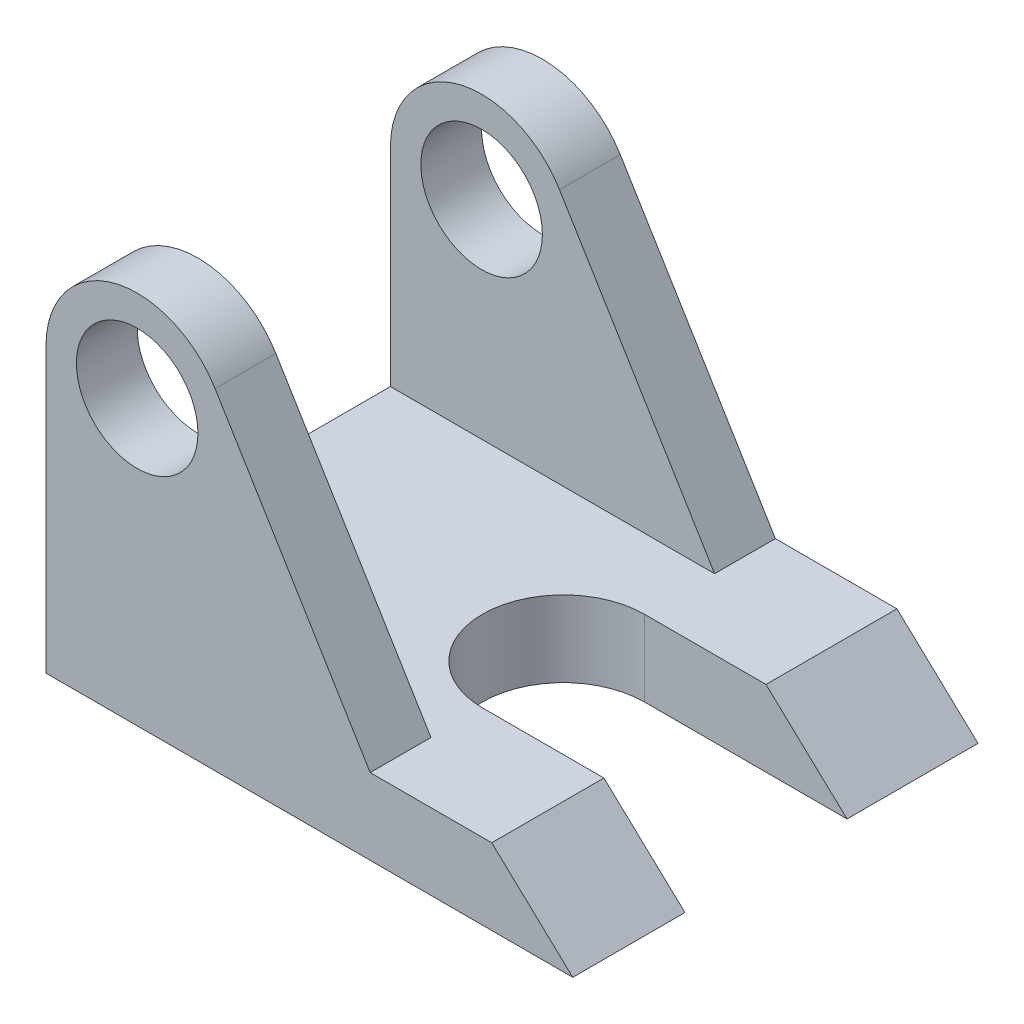
ISO-10303-21;
HEADER;
FILE_DESCRIPTION(('STEP AP214'),'2;1');
FILE_NAME('part.step','',(''),(''),'','','');
FILE_SCHEMA(('AUTOMOTIVE_DESIGN { 1 0 10303 214 1 1 1 1 }'));
ENDSEC;
DATA;
#1=APPLICATION_CONTEXT('core data for automotive mechanical design processes');
#2=APPLICATION_PROTOCOL_DEFINITION('international standard','automotive_design',2000,#1);
#3=PRODUCT_CONTEXT('',#1,'mechanical');
#4=PRODUCT('Part','Part','',(#3));
#5=PRODUCT_RELATED_PRODUCT_CATEGORY('part','',(#4));
#6=PRODUCT_DEFINITION_FORMATION('','',#4);
#7=PRODUCT_DEFINITION_CONTEXT('part definition',#1,'design');
#8=PRODUCT_DEFINITION('design','',#6,#7);
#9=PRODUCT_DEFINITION_SHAPE('','',#8);
#10=(LENGTH_UNIT() NAMED_UNIT(*) SI_UNIT(.MILLI.,.METRE.));
#11=(NAMED_UNIT(*) PLANE_ANGLE_UNIT() SI_UNIT($,.RADIAN.));
#12=(NAMED_UNIT(*) SI_UNIT($,.STERADIAN.) SOLID_ANGLE_UNIT());
#13=UNCERTAINTY_MEASURE_WITH_UNIT(LENGTH_MEASURE(1.E-05),#10,'distance_accuracy_value','');
#14=(GEOMETRIC_REPRESENTATION_CONTEXT(3) GLOBAL_UNCERTAINTY_ASSIGNED_CONTEXT((#13)) GLOBAL_UNIT_ASSIGNED_CONTEXT((#10,
#11,#12)) REPRESENTATION_CONTEXT('',''));
#15=CARTESIAN_POINT('',(0.,0.,0.));
#16=DIRECTION('',(0.,0.,1.));
#17=DIRECTION('',(1.,0.,0.));
#18=AXIS2_PLACEMENT_3D('',#15,#16,#17);
#19=CARTESIAN_POINT('',(80.3668287174947,-4.39949891949709,-100.));
#20=DIRECTION('',(0.684090794937473,0.729396863361652,0.));
#21=DIRECTION('',(-0.729396863361652,0.684090794937473,0.));
#22=AXIS2_PLACEMENT_3D('',#19,#20,#21);
#23=PLANE('',#22);
#24=DIRECTION('',(-0.729396863361652,0.684090794937473,0.));
#25=VECTOR('',#24,1.);
#26=CARTESIAN_POINT('',(80.3668287174947,-4.39949891949709,-67.6838528257323));
#27=LINE('',#26,#25);
#28=CARTESIAN_POINT('',(80.3668287174947,-4.39949891949709,-67.6838528257323));
#29=VERTEX_POINT('',#28);
#30=CARTESIAN_POINT('',(60.3668287174947,14.358212534995,-67.6838528257323));
#31=VERTEX_POINT('',#30);
#32=EDGE_CURVE('E291',#29,#31,#27,.T.);
#33=ORIENTED_EDGE('',*,*,#32,.F.);
#34=DIRECTION('',(0.,0.,1.));
#35=VECTOR('',#34,1.);
#36=CARTESIAN_POINT('',(80.3668287174947,-4.39949891949709,-100.));
#37=LINE('',#36,#35);
#38=CARTESIAN_POINT('',(80.3668287174947,-4.39949891949709,-100.));
#39=VERTEX_POINT('',#38);
#40=EDGE_CURVE('E192',#39,#29,#37,.T.);
#41=ORIENTED_EDGE('',*,*,#40,.F.);
#42=DIRECTION('',(-0.729396863361652,0.684090794937473,0.));
#43=VECTOR('',#42,1.);
#44=CARTESIAN_POINT('',(80.3668287174947,-4.39949891949709,-100.));
#45=LINE('',#44,#43);
#46=CARTESIAN_POINT('',(60.3668287174947,14.358212534995,-100.));
#47=VERTEX_POINT('',#46);
#48=EDGE_CURVE('E242',#39,#47,#45,.T.);
#49=ORIENTED_EDGE('',*,*,#48,.T.);
#50=DIRECTION('',(0.,0.,1.));
#51=VECTOR('',#50,1.);
#52=CARTESIAN_POINT('',(60.3668287174947,14.358212534995,-100.));
#53=LINE('',#52,#51);
#54=EDGE_CURVE('E196',#47,#31,#53,.T.);
#55=ORIENTED_EDGE('',*,*,#54,.T.);
#56=EDGE_LOOP('',(#33,#41,#49,#55));
#57=FACE_BOUND('',#56,.T.);
#58=ADVANCED_FACE('F45',(#57),#23,.T.);
#59=CARTESIAN_POINT('',(-27.1331712825053,65.6005010805029,-100.));
#60=DIRECTION('',(0.,0.,1.));
#61=DIRECTION('',(1.,0.,0.));
#62=AXIS2_PLACEMENT_3D('',#59,#60,#61);
#63=CYLINDRICAL_SURFACE('',#62,22.5);
#64=CARTESIAN_POINT('',(-27.1331712825053,65.6005010805029,-15.));
#65=DIRECTION('',(0.,0.,1.));
#66=DIRECTION('',(0.,-1.,0.));
#67=AXIS2_PLACEMENT_3D('',#64,#65,#66);
#68=CIRCLE('',#67,22.5);
#69=CARTESIAN_POINT('',(-49.6331712825053,65.6005010805029,-15.));
#70=VERTEX_POINT('',#69);
#71=CARTESIAN_POINT('',(-7.90944020395365,77.2923000618199,-15.));
#72=VERTEX_POINT('',#71);
#73=EDGE_CURVE('E267',#70,#72,#68,.F.);
#74=ORIENTED_EDGE('',*,*,#73,.F.);
#75=DIRECTION('',(0.,0.,1.));
#76=VECTOR('',#75,1.);
#77=CARTESIAN_POINT('',(-49.6331712825053,65.6005010805029,-100.));
#78=LINE('',#77,#76);
#79=CARTESIAN_POINT('',(-49.6331712825053,65.6005010805029,0.));
#80=VERTEX_POINT('',#79);
#81=EDGE_CURVE('E188',#70,#80,#78,.T.);
#82=ORIENTED_EDGE('',*,*,#81,.T.);
#83=CARTESIAN_POINT('',(-27.1331712825053,65.6005010805029,0.));
#84=DIRECTION('',(0.,0.,1.));
#85=DIRECTION('',(1.,0.,0.));
#86=AXIS2_PLACEMENT_3D('',#83,#84,#85);
#87=CIRCLE('',#86,22.5);
#88=CARTESIAN_POINT('',(-7.90944020395364,77.2923000618199,0.));
#89=VERTEX_POINT('',#88);
#90=EDGE_CURVE('E229',#89,#80,#87,.T.);
#91=ORIENTED_EDGE('',*,*,#90,.F.);
#92=DIRECTION('',(0.,0.,1.));
#93=VECTOR('',#92,1.);
#94=CARTESIAN_POINT('',(-7.90944020395364,77.2923000618199,-100.));
#95=LINE('',#94,#93);
#96=EDGE_CURVE('E204',#72,#89,#95,.T.);
#97=ORIENTED_EDGE('',*,*,#96,.F.);
#98=EDGE_LOOP('',(#74,#82,#91,#97));
#99=FACE_BOUND('',#98,.T.);
#100=ADVANCED_FACE('F316',(#99),#63,.T.);
#101=CARTESIAN_POINT('',(30.3668287174947,14.358212534995,-100.));
#102=DIRECTION('',(0.854388047935631,0.519635510280756,0.));
#103=DIRECTION('',(-0.519635510280756,0.854388047935631,0.));
#104=AXIS2_PLACEMENT_3D('',#101,#102,#103);
#105=PLANE('',#104);
#106=DIRECTION('',(0.519635510280756,-0.854388047935631,0.));
#107=VECTOR('',#106,1.);
#108=CARTESIAN_POINT('',(30.3668287174947,14.358212534995,-15.));
#109=LINE('',#108,#107);
#110=CARTESIAN_POINT('',(30.3668287174947,14.358212534995,-15.));
#111=VERTEX_POINT('',#110);
#112=EDGE_CURVE('E261',#72,#111,#109,.T.);
#113=ORIENTED_EDGE('',*,*,#112,.F.);
#114=ORIENTED_EDGE('',*,*,#96,.T.);
#115=DIRECTION('',(-0.519635510280756,0.854388047935631,0.));
#116=VECTOR('',#115,1.);
#117=CARTESIAN_POINT('',(30.3668287174947,14.358212534995,0.));
#118=LINE('',#117,#116);
#119=CARTESIAN_POINT('',(30.3668287174947,14.358212534995,0.));
#120=VERTEX_POINT('',#119);
#121=EDGE_CURVE('E208',#120,#89,#118,.T.);
#122=ORIENTED_EDGE('',*,*,#121,.F.);
#123=DIRECTION('',(0.,0.,1.));
#124=VECTOR('',#123,1.);
#125=CARTESIAN_POINT('',(30.3668287174947,14.358212534995,-100.));
#126=LINE('',#125,#124);
#127=EDGE_CURVE('E200',#111,#120,#126,.T.);
#128=ORIENTED_EDGE('',*,*,#127,.F.);
#129=EDGE_LOOP('',(#113,#114,#122,#128));
#130=FACE_BOUND('',#129,.T.);
#131=ADVANCED_FACE('F327',(#130),#105,.T.);
#132=CARTESIAN_POINT('',(-27.1331712825053,65.6005010805029,-100.));
#133=DIRECTION('',(0.,0.,1.));
#134=DIRECTION('',(1.,0.,0.));
#135=AXIS2_PLACEMENT_3D('',#132,#133,#134);
#136=CYLINDRICAL_SURFACE('',#135,15.);
#137=CARTESIAN_POINT('',(-27.1331712825053,65.6005010805029,-15.));
#138=DIRECTION('',(0.,0.,1.));
#139=DIRECTION('',(0.,-1.,0.));
#140=AXIS2_PLACEMENT_3D('',#137,#138,#139);
#141=CIRCLE('',#140,15.);
#142=CARTESIAN_POINT('',(-27.1331712825053,50.6005010805029,-15.));
#143=VERTEX_POINT('',#142);
#144=EDGE_CURVE('E172',#143,#143,#141,.F.);
#145=ORIENTED_EDGE('',*,*,#144,.T.);
#146=EDGE_LOOP('',(#145));
#147=FACE_BOUND('',#146,.T.);
#148=CARTESIAN_POINT('',(-27.1331712825053,65.6005010805029,0.));
#149=DIRECTION('',(0.,0.,1.));
#150=DIRECTION('',(1.,0.,0.));
#151=AXIS2_PLACEMENT_3D('',#148,#149,#150);
#152=CIRCLE('',#151,15.);
#153=CARTESIAN_POINT('',(-12.1331712825053,65.6005010805029,0.));
#154=VERTEX_POINT('',#153);
#155=EDGE_CURVE('E257',#154,#154,#152,.T.);
#156=ORIENTED_EDGE('',*,*,#155,.T.);
#157=EDGE_LOOP('',(#156));
#158=FACE_BOUND('',#157,.T.);
#159=ADVANCED_FACE('F390',(#147,#158),#136,.F.);
#160=CARTESIAN_POINT('',(-49.6331712825053,65.6005010805029,-100.));
#161=VERTEX_POINT('',#160);
#162=CARTESIAN_POINT('',(-49.6331712825053,65.6005010805029,-85.));
#163=VERTEX_POINT('',#162);
#164=EDGE_CURVE('E183',#161,#163,#78,.T.);
#165=ORIENTED_EDGE('',*,*,#164,.T.);
#166=CARTESIAN_POINT('',(-27.1331712825053,65.6005010805029,-85.));
#167=DIRECTION('',(0.,0.,-1.));
#168=DIRECTION('',(0.,1.,0.));
#169=AXIS2_PLACEMENT_3D('',#166,#167,#168);
#170=CIRCLE('',#169,22.5);
#171=CARTESIAN_POINT('',(-7.90944020395365,77.2923000618199,-85.));
#172=VERTEX_POINT('',#171);
#173=EDGE_CURVE('E275',#172,#163,#170,.F.);
#174=ORIENTED_EDGE('',*,*,#173,.F.);
#175=CARTESIAN_POINT('',(-7.90944020395364,77.2923000618199,-100.));
#176=VERTEX_POINT('',#175);
#177=EDGE_CURVE('E171',#176,#172,#95,.T.);
#178=ORIENTED_EDGE('',*,*,#177,.F.);
#179=CARTESIAN_POINT('',(-27.1331712825053,65.6005010805029,-100.));
#180=DIRECTION('',(0.,0.,1.));
#181=DIRECTION('',(1.,0.,0.));
#182=AXIS2_PLACEMENT_3D('',#179,#180,#181);
#183=CIRCLE('',#182,22.5);
#184=EDGE_CURVE('E212',#176,#161,#183,.T.);
#185=ORIENTED_EDGE('',*,*,#184,.T.);
#186=EDGE_LOOP('',(#165,#174,#178,#185));
#187=FACE_BOUND('',#186,.T.);
#188=ADVANCED_FACE('F47',(#187),#63,.T.);
#189=DIRECTION('',(-0.519635510280756,0.854388047935631,0.));
#190=VECTOR('',#189,1.);
#191=CARTESIAN_POINT('',(30.3668287174947,14.358212534995,-85.));
#192=LINE('',#191,#190);
#193=CARTESIAN_POINT('',(30.3668287174947,14.358212534995,-85.));
#194=VERTEX_POINT('',#193);
#195=EDGE_CURVE('E177',#194,#172,#192,.T.);
#196=ORIENTED_EDGE('',*,*,#195,.F.);
#197=CARTESIAN_POINT('',(30.3668287174947,14.358212534995,-100.));
#198=VERTEX_POINT('',#197);
#199=EDGE_CURVE('E201',#198,#194,#126,.T.);
#200=ORIENTED_EDGE('',*,*,#199,.F.);
#201=DIRECTION('',(-0.519635510280756,0.854388047935631,0.));
#202=VECTOR('',#201,1.);
#203=CARTESIAN_POINT('',(30.3668287174947,14.358212534995,-100.));
#204=LINE('',#203,#202);
#205=EDGE_CURVE('E234',#198,#176,#204,.T.);
#206=ORIENTED_EDGE('',*,*,#205,.T.);
#207=ORIENTED_EDGE('',*,*,#177,.T.);
#208=EDGE_LOOP('',(#196,#200,#206,#207));
#209=FACE_BOUND('',#208,.T.);
#210=ADVANCED_FACE('F348',(#209),#105,.T.);
#211=CARTESIAN_POINT('',(60.3668287174947,14.358212534995,-100.));
#212=DIRECTION('',(0.,1.,0.));
#213=DIRECTION('',(-1.,0.,0.));
#214=AXIS2_PLACEMENT_3D('',#211,#212,#213);
#215=PLANE('',#214);
#216=DIRECTION('',(-1.,0.,0.));
#217=VECTOR('',#216,1.);
#218=CARTESIAN_POINT('',(60.3668287174947,14.358212534995,-67.6838528257323));
#219=LINE('',#218,#217);
#220=CARTESIAN_POINT('',(30.3668287174947,14.358212534995,-67.6838528257323));
#221=VERTEX_POINT('',#220);
#222=EDGE_CURVE('E288',#31,#221,#219,.T.);
#223=ORIENTED_EDGE('',*,*,#222,.F.);
#224=ORIENTED_EDGE('',*,*,#54,.F.);
#225=DIRECTION('',(-1.,0.,0.));
#226=VECTOR('',#225,1.);
#227=CARTESIAN_POINT('',(60.3668287174947,14.358212534995,-100.));
#228=LINE('',#227,#226);
#229=EDGE_CURVE('E238',#47,#198,#228,.T.);
#230=ORIENTED_EDGE('',*,*,#229,.T.);
#231=ORIENTED_EDGE('',*,*,#199,.T.);
#232=DIRECTION('',(1.,0.,0.));
#233=VECTOR('',#232,1.);
#234=CARTESIAN_POINT('',(-50.,14.358212534995,-85.));
#235=LINE('',#234,#233);
#236=CARTESIAN_POINT('',(-49.6331712825053,14.358212534995,-85.));
#237=VERTEX_POINT('',#236);
#238=EDGE_CURVE('E69',#237,#194,#235,.T.);
#239=ORIENTED_EDGE('',*,*,#238,.F.);
#240=DIRECTION('',(0.,0.,1.));
#241=VECTOR('',#240,1.);
#242=CARTESIAN_POINT('',(-49.6331712825053,14.358212534995,-100.));
#243=LINE('',#242,#241);
#244=CARTESIAN_POINT('',(-49.6331712825053,14.358212534995,-15.));
#245=VERTEX_POINT('',#244);
#246=EDGE_CURVE('E153',#237,#245,#243,.T.);
#247=ORIENTED_EDGE('',*,*,#246,.T.);
#248=DIRECTION('',(1.,0.,0.));
#249=VECTOR('',#248,1.);
#250=CARTESIAN_POINT('',(-50.,14.358212534995,-15.));
#251=LINE('',#250,#249);
#252=EDGE_CURVE('E280',#245,#111,#251,.T.);
#253=ORIENTED_EDGE('',*,*,#252,.T.);
#254=ORIENTED_EDGE('',*,*,#127,.T.);
#255=DIRECTION('',(-1.,0.,0.));
#256=VECTOR('',#255,1.);
#257=CARTESIAN_POINT('',(60.3668287174947,14.358212534995,0.));
#258=LINE('',#257,#256);
#259=CARTESIAN_POINT('',(60.3668287174947,14.358212534995,0.));
#260=VERTEX_POINT('',#259);
#261=EDGE_CURVE('E213',#260,#120,#258,.T.);
#262=ORIENTED_EDGE('',*,*,#261,.F.);
#263=CARTESIAN_POINT('',(60.3668287174947,14.358212534995,-27.6838528257323));
#264=VERTEX_POINT('',#263);
#265=EDGE_CURVE('E195',#264,#260,#53,.T.);
#266=ORIENTED_EDGE('',*,*,#265,.F.);
#267=DIRECTION('',(1.,0.,0.));
#268=VECTOR('',#267,1.);
#269=CARTESIAN_POINT('',(60.3668287174947,14.358212534995,-27.6838528257323));
#270=LINE('',#269,#268);
#271=CARTESIAN_POINT('',(30.3668287174947,14.358212534995,-27.6838528257323));
#272=VERTEX_POINT('',#271);
#273=EDGE_CURVE('E294',#272,#264,#270,.T.);
#274=ORIENTED_EDGE('',*,*,#273,.F.);
#275=CARTESIAN_POINT('',(30.3668287174947,14.358212534995,-47.6838528257323));
#276=DIRECTION('',(0.,1.,0.));
#277=DIRECTION('',(-1.,0.,0.));
#278=AXIS2_PLACEMENT_3D('',#275,#276,#277);
#279=CIRCLE('',#278,20.);
#280=EDGE_CURVE('E160',#221,#272,#279,.T.);
#281=ORIENTED_EDGE('',*,*,#280,.F.);
#282=EDGE_LOOP('',(#223,#224,#230,#231,#239,#247,#253,#254,#262,#266,#274,#281));
#283=FACE_BOUND('',#282,.T.);
#284=ADVANCED_FACE('F302',(#283),#215,.T.);
#285=DIRECTION('',(0.729396863361652,-0.684090794937473,0.));
#286=VECTOR('',#285,1.);
#287=CARTESIAN_POINT('',(80.3668287174947,-4.39949891949709,-27.6838528257323));
#288=LINE('',#287,#286);
#289=CARTESIAN_POINT('',(80.3668287174947,-4.39949891949709,-27.6838528257323));
#290=VERTEX_POINT('',#289);
#291=EDGE_CURVE('E61',#264,#290,#288,.T.);
#292=ORIENTED_EDGE('',*,*,#291,.F.);
#293=ORIENTED_EDGE('',*,*,#265,.T.);
#294=DIRECTION('',(-0.729396863361652,0.684090794937473,0.));
#295=VECTOR('',#294,1.);
#296=CARTESIAN_POINT('',(80.3668287174947,-4.39949891949709,0.));
#297=LINE('',#296,#295);
#298=CARTESIAN_POINT('',(80.3668287174947,-4.39949891949709,0.));
#299=VERTEX_POINT('',#298);
#300=EDGE_CURVE('E217',#299,#260,#297,.T.);
#301=ORIENTED_EDGE('',*,*,#300,.F.);
#302=EDGE_CURVE('E191',#290,#299,#37,.T.);
#303=ORIENTED_EDGE('',*,*,#302,.F.);
#304=EDGE_LOOP('',(#292,#293,#301,#303));
#305=FACE_BOUND('',#304,.T.);
#306=ADVANCED_FACE('F306',(#305),#23,.T.);
#307=CARTESIAN_POINT('',(-49.6331712825053,-4.39949891949709,-100.));
#308=DIRECTION('',(0.,-1.,0.));
#309=DIRECTION('',(0.,0.,-1.));
#310=AXIS2_PLACEMENT_3D('',#307,#308,#309);
#311=PLANE('',#310);
#312=DIRECTION('',(1.,0.,0.));
#313=VECTOR('',#312,1.);
#314=CARTESIAN_POINT('',(-49.6331712825053,-4.39949891949709,-67.6838528257323));
#315=LINE('',#314,#313);
#316=CARTESIAN_POINT('',(30.3668287174947,-4.39949891949709,-67.6838528257323));
#317=VERTEX_POINT('',#316);
#318=EDGE_CURVE('E11',#317,#29,#315,.T.);
#319=ORIENTED_EDGE('',*,*,#318,.F.);
#320=CARTESIAN_POINT('',(30.3668287174947,-4.39949891949709,-47.6838528257323));
#321=DIRECTION('',(0.,-1.,0.));
#322=DIRECTION('',(0.,0.,-1.));
#323=AXIS2_PLACEMENT_3D('',#320,#321,#322);
#324=CIRCLE('',#323,20.);
#325=CARTESIAN_POINT('',(30.3668287174947,-4.39949891949709,-27.6838528257323));
#326=VERTEX_POINT('',#325);
#327=EDGE_CURVE('E54',#326,#317,#324,.T.);
#328=ORIENTED_EDGE('',*,*,#327,.F.);
#329=DIRECTION('',(-1.,0.,0.));
#330=VECTOR('',#329,1.);
#331=CARTESIAN_POINT('',(-49.6331712825053,-4.39949891949709,-27.6838528257323));
#332=LINE('',#331,#330);
#333=EDGE_CURVE('E144',#290,#326,#332,.T.);
#334=ORIENTED_EDGE('',*,*,#333,.F.);
#335=ORIENTED_EDGE('',*,*,#302,.T.);
#336=DIRECTION('',(1.,0.,0.));
#337=VECTOR('',#336,1.);
#338=CARTESIAN_POINT('',(-49.6331712825053,-4.39949891949709,0.));
#339=LINE('',#338,#337);
#340=CARTESIAN_POINT('',(-49.6331712825053,-4.39949891949709,0.));
#341=VERTEX_POINT('',#340);
#342=EDGE_CURVE('E221',#341,#299,#339,.T.);
#343=ORIENTED_EDGE('',*,*,#342,.F.);
#344=DIRECTION('',(0.,0.,1.));
#345=VECTOR('',#344,1.);
#346=CARTESIAN_POINT('',(-49.6331712825053,-4.39949891949709,-100.));
#347=LINE('',#346,#345);
#348=CARTESIAN_POINT('',(-49.6331712825053,-4.39949891949709,-100.));
#349=VERTEX_POINT('',#348);
#350=EDGE_CURVE('E187',#349,#341,#347,.T.);
#351=ORIENTED_EDGE('',*,*,#350,.F.);
#352=DIRECTION('',(1.,0.,0.));
#353=VECTOR('',#352,1.);
#354=CARTESIAN_POINT('',(-49.6331712825053,-4.39949891949709,-100.));
#355=LINE('',#354,#353);
#356=EDGE_CURVE('E246',#349,#39,#355,.T.);
#357=ORIENTED_EDGE('',*,*,#356,.T.);
#358=ORIENTED_EDGE('',*,*,#40,.T.);
#359=EDGE_LOOP('',(#319,#328,#334,#335,#343,#351,#357,#358));
#360=FACE_BOUND('',#359,.T.);
#361=ADVANCED_FACE('F165',(#360),#311,.T.);
#362=CARTESIAN_POINT('',(-49.6331712825053,65.6005010805029,-100.));
#363=DIRECTION('',(-1.,0.,0.));
#364=DIRECTION('',(0.,-1.,0.));
#365=AXIS2_PLACEMENT_3D('',#362,#363,#364);
#366=PLANE('',#365);
#367=DIRECTION('',(0.,1.,0.));
#368=VECTOR('',#367,1.);
#369=CARTESIAN_POINT('',(-49.6331712825053,65.6005010805029,-15.));
#370=LINE('',#369,#368);
#371=EDGE_CURVE('E176',#245,#70,#370,.T.);
#372=ORIENTED_EDGE('',*,*,#371,.F.);
#373=ORIENTED_EDGE('',*,*,#246,.F.);
#374=DIRECTION('',(0.,-1.,0.));
#375=VECTOR('',#374,1.);
#376=CARTESIAN_POINT('',(-49.6331712825053,65.6005010805029,-85.));
#377=LINE('',#376,#375);
#378=EDGE_CURVE('E182',#163,#237,#377,.T.);
#379=ORIENTED_EDGE('',*,*,#378,.F.);
#380=ORIENTED_EDGE('',*,*,#164,.F.);
#381=DIRECTION('',(0.,-1.,0.));
#382=VECTOR('',#381,1.);
#383=CARTESIAN_POINT('',(-49.6331712825053,65.6005010805029,-100.));
#384=LINE('',#383,#382);
#385=EDGE_CURVE('E250',#161,#349,#384,.T.);
#386=ORIENTED_EDGE('',*,*,#385,.T.);
#387=ORIENTED_EDGE('',*,*,#350,.T.);
#388=DIRECTION('',(0.,-1.,0.));
#389=VECTOR('',#388,1.);
#390=CARTESIAN_POINT('',(-49.6331712825053,65.6005010805029,0.));
#391=LINE('',#390,#389);
#392=EDGE_CURVE('E225',#80,#341,#391,.T.);
#393=ORIENTED_EDGE('',*,*,#392,.F.);
#394=ORIENTED_EDGE('',*,*,#81,.F.);
#395=EDGE_LOOP('',(#372,#373,#379,#380,#386,#387,#393,#394));
#396=FACE_BOUND('',#395,.T.);
#397=ADVANCED_FACE('F320',(#396),#366,.T.);
#398=CARTESIAN_POINT('',(-27.1331712825053,65.6005010805029,-100.));
#399=DIRECTION('',(0.,0.,1.));
#400=DIRECTION('',(1.,0.,0.));
#401=AXIS2_PLACEMENT_3D('',#398,#399,#400);
#402=PLANE('',#401);
#403=CARTESIAN_POINT('',(-27.1331712825053,65.6005010805029,-100.));
#404=DIRECTION('',(0.,0.,1.));
#405=DIRECTION('',(1.,0.,0.));
#406=AXIS2_PLACEMENT_3D('',#403,#404,#405);
#407=CIRCLE('',#406,15.);
#408=CARTESIAN_POINT('',(-12.1331712825053,65.6005010805029,-100.));
#409=VERTEX_POINT('',#408);
#410=EDGE_CURVE('E233',#409,#409,#407,.T.);
#411=ORIENTED_EDGE('',*,*,#410,.T.);
#412=EDGE_LOOP('',(#411));
#413=FACE_BOUND('',#412,.T.);
#414=ORIENTED_EDGE('',*,*,#184,.F.);
#415=ORIENTED_EDGE('',*,*,#205,.F.);
#416=ORIENTED_EDGE('',*,*,#229,.F.);
#417=ORIENTED_EDGE('',*,*,#48,.F.);
#418=ORIENTED_EDGE('',*,*,#356,.F.);
#419=ORIENTED_EDGE('',*,*,#385,.F.);
#420=EDGE_LOOP('',(#414,#415,#416,#417,#418,#419));
#421=FACE_BOUND('',#420,.T.);
#422=ADVANCED_FACE('F343',(#413,#421),#402,.F.);
#423=CARTESIAN_POINT('',(-27.1331712825053,65.6005010805029,0.));
#424=DIRECTION('',(0.,0.,1.));
#425=DIRECTION('',(1.,0.,0.));
#426=AXIS2_PLACEMENT_3D('',#423,#424,#425);
#427=PLANE('',#426);
#428=ORIENTED_EDGE('',*,*,#155,.F.);
#429=EDGE_LOOP('',(#428));
#430=FACE_BOUND('',#429,.T.);
#431=ORIENTED_EDGE('',*,*,#90,.T.);
#432=ORIENTED_EDGE('',*,*,#392,.T.);
#433=ORIENTED_EDGE('',*,*,#342,.T.);
#434=ORIENTED_EDGE('',*,*,#300,.T.);
#435=ORIENTED_EDGE('',*,*,#261,.T.);
#436=ORIENTED_EDGE('',*,*,#121,.T.);
#437=EDGE_LOOP('',(#431,#432,#433,#434,#435,#436));
#438=FACE_BOUND('',#437,.T.);
#439=ADVANCED_FACE('F322',(#430,#438),#427,.T.);
#440=CARTESIAN_POINT('',(-27.1331712825053,65.6005010805029,-85.));
#441=DIRECTION('',(0.,0.,-1.));
#442=DIRECTION('',(0.,1.,0.));
#443=AXIS2_PLACEMENT_3D('',#440,#441,#442);
#444=CIRCLE('',#443,15.);
#445=CARTESIAN_POINT('',(-27.1331712825053,80.6005010805029,-85.));
#446=VERTEX_POINT('',#445);
#447=EDGE_CURVE('E178',#446,#446,#444,.F.);
#448=ORIENTED_EDGE('',*,*,#447,.T.);
#449=EDGE_LOOP('',(#448));
#450=FACE_BOUND('',#449,.T.);
#451=ORIENTED_EDGE('',*,*,#410,.F.);
#452=EDGE_LOOP('',(#451));
#453=FACE_BOUND('',#452,.T.);
#454=ADVANCED_FACE('F382',(#450,#453),#136,.F.);
#455=CARTESIAN_POINT('',(-50.,88.1005010805029,-15.));
#456=DIRECTION('',(0.,0.,1.));
#457=DIRECTION('',(0.,-1.,0.));
#458=AXIS2_PLACEMENT_3D('',#455,#456,#457);
#459=PLANE('',#458);
#460=ORIENTED_EDGE('',*,*,#112,.T.);
#461=ORIENTED_EDGE('',*,*,#252,.F.);
#462=ORIENTED_EDGE('',*,*,#371,.T.);
#463=ORIENTED_EDGE('',*,*,#73,.T.);
#464=EDGE_LOOP('',(#460,#461,#462,#463));
#465=FACE_BOUND('',#464,.T.);
#466=ORIENTED_EDGE('',*,*,#144,.F.);
#467=EDGE_LOOP('',(#466));
#468=FACE_BOUND('',#467,.T.);
#469=ADVANCED_FACE('F333',(#465,#468),#459,.F.);
#470=CARTESIAN_POINT('',(-50.,88.1005010805029,-85.));
#471=DIRECTION('',(0.,0.,-1.));
#472=DIRECTION('',(0.,1.,0.));
#473=AXIS2_PLACEMENT_3D('',#470,#471,#472);
#474=PLANE('',#473);
#475=ORIENTED_EDGE('',*,*,#195,.T.);
#476=ORIENTED_EDGE('',*,*,#173,.T.);
#477=ORIENTED_EDGE('',*,*,#378,.T.);
#478=ORIENTED_EDGE('',*,*,#238,.T.);
#479=EDGE_LOOP('',(#475,#476,#477,#478));
#480=FACE_BOUND('',#479,.T.);
#481=ORIENTED_EDGE('',*,*,#447,.F.);
#482=EDGE_LOOP('',(#481));
#483=FACE_BOUND('',#482,.T.);
#484=ADVANCED_FACE('F360',(#480,#483),#474,.F.);
#485=CARTESIAN_POINT('',(30.3668287174947,-5.641787465005,-47.6838528257323));
#486=DIRECTION('',(0.,1.,0.));
#487=DIRECTION('',(-1.,0.,0.));
#488=AXIS2_PLACEMENT_3D('',#485,#486,#487);
#489=CYLINDRICAL_SURFACE('',#488,20.);
#490=ORIENTED_EDGE('',*,*,#280,.T.);
#491=DIRECTION('',(0.,1.,0.));
#492=VECTOR('',#491,1.);
#493=CARTESIAN_POINT('',(30.3668287174947,-5.641787465005,-27.6838528257323));
#494=LINE('',#493,#492);
#495=EDGE_CURVE('E147',#326,#272,#494,.T.);
#496=ORIENTED_EDGE('',*,*,#495,.F.);
#497=ORIENTED_EDGE('',*,*,#327,.T.);
#498=DIRECTION('',(0.,1.,0.));
#499=VECTOR('',#498,1.);
#500=CARTESIAN_POINT('',(30.3668287174947,-5.641787465005,-67.6838528257323));
#501=LINE('',#500,#499);
#502=EDGE_CURVE('E162',#317,#221,#501,.T.);
#503=ORIENTED_EDGE('',*,*,#502,.T.);
#504=EDGE_LOOP('',(#490,#496,#497,#503));
#505=FACE_BOUND('',#504,.T.);
#506=ADVANCED_FACE('F156',(#505),#489,.F.);
#507=CARTESIAN_POINT('',(30.3668287174947,-5.641787465005,-67.6838528257323));
#508=DIRECTION('',(0.,0.,-1.));
#509=DIRECTION('',(-1.,0.,0.));
#510=AXIS2_PLACEMENT_3D('',#507,#508,#509);
#511=PLANE('',#510);
#512=ORIENTED_EDGE('',*,*,#222,.T.);
#513=ORIENTED_EDGE('',*,*,#502,.F.);
#514=ORIENTED_EDGE('',*,*,#318,.T.);
#515=ORIENTED_EDGE('',*,*,#32,.T.);
#516=EDGE_LOOP('',(#512,#513,#514,#515));
#517=FACE_BOUND('',#516,.T.);
#518=ADVANCED_FACE('F352',(#517),#511,.F.);
#519=CARTESIAN_POINT('',(30.3668287174947,-5.641787465005,-27.6838528257323));
#520=DIRECTION('',(0.,0.,1.));
#521=DIRECTION('',(1.,0.,0.));
#522=AXIS2_PLACEMENT_3D('',#519,#520,#521);
#523=PLANE('',#522);
#524=ORIENTED_EDGE('',*,*,#273,.T.);
#525=ORIENTED_EDGE('',*,*,#291,.T.);
#526=ORIENTED_EDGE('',*,*,#333,.T.);
#527=ORIENTED_EDGE('',*,*,#495,.T.);
#528=EDGE_LOOP('',(#524,#525,#526,#527));
#529=FACE_BOUND('',#528,.T.);
#530=ADVANCED_FACE('F146',(#529),#523,.F.);
#531=CLOSED_SHELL('',(#58,#100,#131,#159,#188,#210,#284,#306,#361,#397,#422,#439,#454,#469,#484,
#506,#518,#530));
#532=MANIFOLD_SOLID_BREP('B2',#531);
#533=ADVANCED_BREP_SHAPE_REPRESENTATION('',(#18,#532),#14);
#534=SHAPE_DEFINITION_REPRESENTATION(#9,#533);
ENDSEC;
END-ISO-10303-21;
